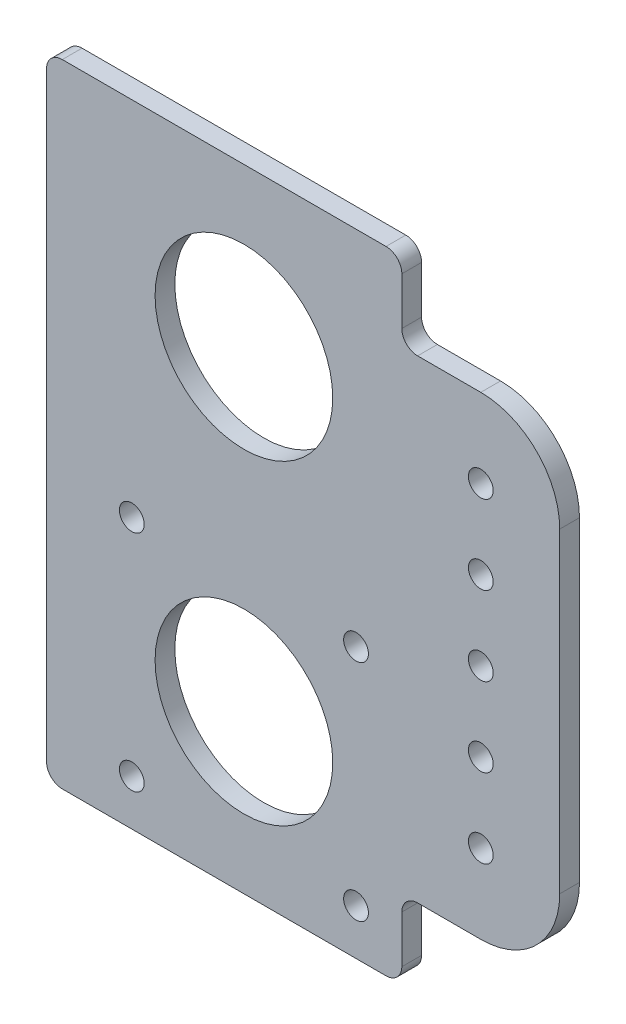
ISO-10303-21;
HEADER;
FILE_DESCRIPTION(('STEP AP214'),'2;1');
FILE_NAME('part.step','',(''),(''),'','','');
FILE_SCHEMA(('AUTOMOTIVE_DESIGN { 1 0 10303 214 1 1 1 1 }'));
ENDSEC;
DATA;
#1=APPLICATION_CONTEXT('core data for automotive mechanical design processes');
#2=APPLICATION_PROTOCOL_DEFINITION('international standard','automotive_design',2000,#1);
#3=PRODUCT_CONTEXT('',#1,'mechanical');
#4=PRODUCT('Part','Part','',(#3));
#5=PRODUCT_RELATED_PRODUCT_CATEGORY('part','',(#4));
#6=PRODUCT_DEFINITION_FORMATION('','',#4);
#7=PRODUCT_DEFINITION_CONTEXT('part definition',#1,'design');
#8=PRODUCT_DEFINITION('design','',#6,#7);
#9=PRODUCT_DEFINITION_SHAPE('','',#8);
#10=(LENGTH_UNIT() NAMED_UNIT(*) SI_UNIT(.MILLI.,.METRE.));
#11=(NAMED_UNIT(*) PLANE_ANGLE_UNIT() SI_UNIT($,.RADIAN.));
#12=(NAMED_UNIT(*) SI_UNIT($,.STERADIAN.) SOLID_ANGLE_UNIT());
#13=UNCERTAINTY_MEASURE_WITH_UNIT(LENGTH_MEASURE(1.E-05),#10,'distance_accuracy_value','');
#14=(GEOMETRIC_REPRESENTATION_CONTEXT(3) GLOBAL_UNCERTAINTY_ASSIGNED_CONTEXT((#13)) GLOBAL_UNIT_ASSIGNED_CONTEXT((#10,
#11,#12)) REPRESENTATION_CONTEXT('',''));
#15=CARTESIAN_POINT('',(0.,0.,0.));
#16=DIRECTION('',(0.,0.,1.));
#17=DIRECTION('',(1.,0.,0.));
#18=AXIS2_PLACEMENT_3D('',#15,#16,#17);
#19=CARTESIAN_POINT('',(38.1,0.,3.175));
#20=DIRECTION('',(0.,0.,-1.));
#21=DIRECTION('',(-1.,0.,0.));
#22=AXIS2_PLACEMENT_3D('',#19,#20,#21);
#23=CYLINDRICAL_SURFACE('',#22,12.7);
#24=CARTESIAN_POINT('',(38.1,0.,0.));
#25=DIRECTION('',(0.,0.,1.));
#26=DIRECTION('',(1.,0.,0.));
#27=AXIS2_PLACEMENT_3D('',#24,#25,#26);
#28=CIRCLE('',#27,12.7);
#29=CARTESIAN_POINT('',(50.8,0.,0.));
#30=VERTEX_POINT('',#29);
#31=CARTESIAN_POINT('',(38.1,-12.7,0.));
#32=VERTEX_POINT('',#31);
#33=EDGE_CURVE('E153',#30,#32,#28,.F.);
#34=ORIENTED_EDGE('',*,*,#33,.F.);
#35=DIRECTION('',(0.,0.,-1.));
#36=VECTOR('',#35,1.);
#37=CARTESIAN_POINT('',(50.8,0.,3.175));
#38=LINE('',#37,#36);
#39=CARTESIAN_POINT('',(50.8,0.,3.175));
#40=VERTEX_POINT('',#39);
#41=EDGE_CURVE('E148',#40,#30,#38,.T.);
#42=ORIENTED_EDGE('',*,*,#41,.F.);
#43=CARTESIAN_POINT('',(38.1,0.,3.175));
#44=DIRECTION('',(0.,0.,1.));
#45=DIRECTION('',(1.,0.,0.));
#46=AXIS2_PLACEMENT_3D('',#43,#44,#45);
#47=CIRCLE('',#46,12.7);
#48=CARTESIAN_POINT('',(38.1,-12.7,3.175));
#49=VERTEX_POINT('',#48);
#50=EDGE_CURVE('E150',#40,#49,#47,.F.);
#51=ORIENTED_EDGE('',*,*,#50,.T.);
#52=DIRECTION('',(0.,0.,-1.));
#53=VECTOR('',#52,1.);
#54=CARTESIAN_POINT('',(38.1,-12.7,3.175));
#55=LINE('',#54,#53);
#56=EDGE_CURVE('E225',#49,#32,#55,.T.);
#57=ORIENTED_EDGE('',*,*,#56,.T.);
#58=EDGE_LOOP('',(#34,#42,#51,#57));
#59=FACE_BOUND('',#58,.T.);
#60=ADVANCED_FACE('F34',(#59),#23,.T.);
#61=CARTESIAN_POINT('',(50.8,0.,3.175));
#62=DIRECTION('',(1.,0.,0.));
#63=DIRECTION('',(0.,1.,0.));
#64=AXIS2_PLACEMENT_3D('',#61,#62,#63);
#65=PLANE('',#64);
#66=DIRECTION('',(0.,-1.,0.));
#67=VECTOR('',#66,1.);
#68=CARTESIAN_POINT('',(50.8,0.,0.));
#69=LINE('',#68,#67);
#70=CARTESIAN_POINT('',(50.8,50.8,0.));
#71=VERTEX_POINT('',#70);
#72=EDGE_CURVE('E230',#71,#30,#69,.T.);
#73=ORIENTED_EDGE('',*,*,#72,.F.);
#74=DIRECTION('',(0.,0.,-1.));
#75=VECTOR('',#74,1.);
#76=CARTESIAN_POINT('',(50.8,50.8,3.175));
#77=LINE('',#76,#75);
#78=CARTESIAN_POINT('',(50.8,50.8,3.175));
#79=VERTEX_POINT('',#78);
#80=EDGE_CURVE('E159',#79,#71,#77,.T.);
#81=ORIENTED_EDGE('',*,*,#80,.F.);
#82=DIRECTION('',(0.,-1.,0.));
#83=VECTOR('',#82,1.);
#84=CARTESIAN_POINT('',(50.8,0.,3.175));
#85=LINE('',#84,#83);
#86=EDGE_CURVE('E166',#79,#40,#85,.T.);
#87=ORIENTED_EDGE('',*,*,#86,.T.);
#88=ORIENTED_EDGE('',*,*,#41,.T.);
#89=EDGE_LOOP('',(#73,#81,#87,#88));
#90=FACE_BOUND('',#89,.T.);
#91=ADVANCED_FACE('F171',(#90),#65,.T.);
#92=CARTESIAN_POINT('',(38.1,50.8,3.175));
#93=DIRECTION('',(0.,0.,-1.));
#94=DIRECTION('',(-1.,0.,0.));
#95=AXIS2_PLACEMENT_3D('',#92,#93,#94);
#96=CYLINDRICAL_SURFACE('',#95,12.7);
#97=CARTESIAN_POINT('',(38.1,50.8,0.));
#98=DIRECTION('',(0.,0.,1.));
#99=DIRECTION('',(1.,0.,0.));
#100=AXIS2_PLACEMENT_3D('',#97,#98,#99);
#101=CIRCLE('',#100,12.7);
#102=CARTESIAN_POINT('',(38.1,63.5,0.));
#103=VERTEX_POINT('',#102);
#104=EDGE_CURVE('E232',#71,#103,#101,.T.);
#105=ORIENTED_EDGE('',*,*,#104,.T.);
#106=DIRECTION('',(0.,0.,-1.));
#107=VECTOR('',#106,1.);
#108=CARTESIAN_POINT('',(38.1,63.5,3.175));
#109=LINE('',#108,#107);
#110=CARTESIAN_POINT('',(38.1,63.5,3.175));
#111=VERTEX_POINT('',#110);
#112=EDGE_CURVE('E286',#111,#103,#109,.T.);
#113=ORIENTED_EDGE('',*,*,#112,.F.);
#114=CARTESIAN_POINT('',(38.1,50.8,3.175));
#115=DIRECTION('',(0.,0.,1.));
#116=DIRECTION('',(1.,0.,0.));
#117=AXIS2_PLACEMENT_3D('',#114,#115,#116);
#118=CIRCLE('',#117,12.7);
#119=EDGE_CURVE('E173',#79,#111,#118,.T.);
#120=ORIENTED_EDGE('',*,*,#119,.F.);
#121=ORIENTED_EDGE('',*,*,#80,.T.);
#122=EDGE_LOOP('',(#105,#113,#120,#121));
#123=FACE_BOUND('',#122,.T.);
#124=ADVANCED_FACE('F391',(#123),#96,.T.);
#125=CARTESIAN_POINT('',(0.,63.5,3.175));
#126=DIRECTION('',(0.,-1.,0.));
#127=DIRECTION('',(0.,0.,-1.));
#128=AXIS2_PLACEMENT_3D('',#125,#126,#127);
#129=PLANE('',#128);
#130=DIRECTION('',(-1.,0.,0.));
#131=VECTOR('',#130,1.);
#132=CARTESIAN_POINT('',(0.,63.5,0.));
#133=LINE('',#132,#131);
#134=CARTESIAN_POINT('',(27.94,63.5,0.));
#135=VERTEX_POINT('',#134);
#136=EDGE_CURVE('E235',#103,#135,#133,.T.);
#137=ORIENTED_EDGE('',*,*,#136,.T.);
#138=DIRECTION('',(0.,0.,-1.));
#139=VECTOR('',#138,1.);
#140=CARTESIAN_POINT('',(27.94,63.5,3.175));
#141=LINE('',#140,#139);
#142=CARTESIAN_POINT('',(27.94,63.5,3.175));
#143=VERTEX_POINT('',#142);
#144=EDGE_CURVE('E331',#135,#143,#141,.F.);
#145=ORIENTED_EDGE('',*,*,#144,.T.);
#146=DIRECTION('',(-1.,0.,0.));
#147=VECTOR('',#146,1.);
#148=CARTESIAN_POINT('',(0.,63.5,3.175));
#149=LINE('',#148,#147);
#150=EDGE_CURVE('E175',#111,#143,#149,.T.);
#151=ORIENTED_EDGE('',*,*,#150,.F.);
#152=ORIENTED_EDGE('',*,*,#112,.T.);
#153=EDGE_LOOP('',(#137,#145,#151,#152));
#154=FACE_BOUND('',#153,.T.);
#155=ADVANCED_FACE('F345',(#154),#129,.F.);
#156=CARTESIAN_POINT('',(25.4,0.,3.175));
#157=DIRECTION('',(1.,0.,0.));
#158=DIRECTION('',(0.,1.,0.));
#159=AXIS2_PLACEMENT_3D('',#156,#157,#158);
#160=PLANE('',#159);
#161=DIRECTION('',(0.,-1.,0.));
#162=VECTOR('',#161,1.);
#163=CARTESIAN_POINT('',(25.4,0.,0.));
#164=LINE('',#163,#162);
#165=CARTESIAN_POINT('',(25.4,73.66,0.));
#166=VERTEX_POINT('',#165);
#167=CARTESIAN_POINT('',(25.4,66.04,0.));
#168=VERTEX_POINT('',#167);
#169=EDGE_CURVE('E238',#166,#168,#164,.T.);
#170=ORIENTED_EDGE('',*,*,#169,.F.);
#171=DIRECTION('',(0.,0.,-1.));
#172=VECTOR('',#171,1.);
#173=CARTESIAN_POINT('',(25.4,73.66,3.175));
#174=LINE('',#173,#172);
#175=CARTESIAN_POINT('',(25.4,73.66,3.175));
#176=VERTEX_POINT('',#175);
#177=EDGE_CURVE('E329',#166,#176,#174,.F.);
#178=ORIENTED_EDGE('',*,*,#177,.T.);
#179=DIRECTION('',(0.,-1.,0.));
#180=VECTOR('',#179,1.);
#181=CARTESIAN_POINT('',(25.4,0.,3.175));
#182=LINE('',#181,#180);
#183=CARTESIAN_POINT('',(25.4,66.04,3.175));
#184=VERTEX_POINT('',#183);
#185=EDGE_CURVE('E181',#176,#184,#182,.T.);
#186=ORIENTED_EDGE('',*,*,#185,.T.);
#187=DIRECTION('',(0.,0.,-1.));
#188=VECTOR('',#187,1.);
#189=CARTESIAN_POINT('',(25.4,66.04,3.175));
#190=LINE('',#189,#188);
#191=EDGE_CURVE('E326',#184,#168,#190,.T.);
#192=ORIENTED_EDGE('',*,*,#191,.T.);
#193=EDGE_LOOP('',(#170,#178,#186,#192));
#194=FACE_BOUND('',#193,.T.);
#195=ADVANCED_FACE('F351',(#194),#160,.T.);
#196=CARTESIAN_POINT('',(0.,76.2,3.175));
#197=DIRECTION('',(0.,1.,0.));
#198=DIRECTION('',(0.,0.,1.));
#199=AXIS2_PLACEMENT_3D('',#196,#197,#198);
#200=PLANE('',#199);
#201=DIRECTION('',(1.,0.,0.));
#202=VECTOR('',#201,1.);
#203=CARTESIAN_POINT('',(0.,76.2,0.));
#204=LINE('',#203,#202);
#205=CARTESIAN_POINT('',(-29.21,76.2,0.));
#206=VERTEX_POINT('',#205);
#207=CARTESIAN_POINT('',(22.86,76.2,0.));
#208=VERTEX_POINT('',#207);
#209=EDGE_CURVE('E241',#206,#208,#204,.T.);
#210=ORIENTED_EDGE('',*,*,#209,.F.);
#211=DIRECTION('',(0.,0.,-1.));
#212=VECTOR('',#211,1.);
#213=CARTESIAN_POINT('',(-29.21,76.2,3.175));
#214=LINE('',#213,#212);
#215=CARTESIAN_POINT('',(-29.21,76.2,3.175));
#216=VERTEX_POINT('',#215);
#217=EDGE_CURVE('E324',#206,#216,#214,.F.);
#218=ORIENTED_EDGE('',*,*,#217,.T.);
#219=DIRECTION('',(1.,0.,0.));
#220=VECTOR('',#219,1.);
#221=CARTESIAN_POINT('',(0.,76.2,3.175));
#222=LINE('',#221,#220);
#223=CARTESIAN_POINT('',(22.86,76.2,3.175));
#224=VERTEX_POINT('',#223);
#225=EDGE_CURVE('E184',#216,#224,#222,.T.);
#226=ORIENTED_EDGE('',*,*,#225,.T.);
#227=DIRECTION('',(0.,0.,-1.));
#228=VECTOR('',#227,1.);
#229=CARTESIAN_POINT('',(22.86,76.2,3.175));
#230=LINE('',#229,#228);
#231=EDGE_CURVE('E321',#224,#208,#230,.T.);
#232=ORIENTED_EDGE('',*,*,#231,.T.);
#233=EDGE_LOOP('',(#210,#218,#226,#232));
#234=FACE_BOUND('',#233,.T.);
#235=ADVANCED_FACE('F358',(#234),#200,.T.);
#236=CARTESIAN_POINT('',(-31.75,0.,3.175));
#237=DIRECTION('',(1.,0.,0.));
#238=DIRECTION('',(0.,1.,0.));
#239=AXIS2_PLACEMENT_3D('',#236,#237,#238);
#240=PLANE('',#239);
#241=DIRECTION('',(0.,-1.,0.));
#242=VECTOR('',#241,1.);
#243=CARTESIAN_POINT('',(-31.75,0.,0.));
#244=LINE('',#243,#242);
#245=CARTESIAN_POINT('',(-31.75,73.66,0.));
#246=VERTEX_POINT('',#245);
#247=CARTESIAN_POINT('',(-31.75,-22.86,0.));
#248=VERTEX_POINT('',#247);
#249=EDGE_CURVE('E244',#246,#248,#244,.T.);
#250=ORIENTED_EDGE('',*,*,#249,.T.);
#251=DIRECTION('',(0.,0.,-1.));
#252=VECTOR('',#251,1.);
#253=CARTESIAN_POINT('',(-31.75,-22.86,3.175));
#254=LINE('',#253,#252);
#255=CARTESIAN_POINT('',(-31.75,-22.86,3.175));
#256=VERTEX_POINT('',#255);
#257=EDGE_CURVE('E49',#248,#256,#254,.F.);
#258=ORIENTED_EDGE('',*,*,#257,.T.);
#259=DIRECTION('',(0.,-1.,0.));
#260=VECTOR('',#259,1.);
#261=CARTESIAN_POINT('',(-31.75,0.,3.175));
#262=LINE('',#261,#260);
#263=CARTESIAN_POINT('',(-31.75,73.66,3.175));
#264=VERTEX_POINT('',#263);
#265=EDGE_CURVE('E187',#264,#256,#262,.T.);
#266=ORIENTED_EDGE('',*,*,#265,.F.);
#267=DIRECTION('',(0.,0.,-1.));
#268=VECTOR('',#267,1.);
#269=CARTESIAN_POINT('',(-31.75,73.66,0.));
#270=LINE('',#269,#268);
#271=EDGE_CURVE('E317',#264,#246,#270,.T.);
#272=ORIENTED_EDGE('',*,*,#271,.T.);
#273=EDGE_LOOP('',(#250,#258,#266,#272));
#274=FACE_BOUND('',#273,.T.);
#275=ADVANCED_FACE('F364',(#274),#240,.F.);
#276=CARTESIAN_POINT('',(0.,-25.4,3.175));
#277=DIRECTION('',(0.,1.,0.));
#278=DIRECTION('',(0.,0.,1.));
#279=AXIS2_PLACEMENT_3D('',#276,#277,#278);
#280=PLANE('',#279);
#281=DIRECTION('',(1.,0.,0.));
#282=VECTOR('',#281,1.);
#283=CARTESIAN_POINT('',(0.,-25.4,0.));
#284=LINE('',#283,#282);
#285=CARTESIAN_POINT('',(-29.21,-25.4,0.));
#286=VERTEX_POINT('',#285);
#287=CARTESIAN_POINT('',(22.86,-25.4,0.));
#288=VERTEX_POINT('',#287);
#289=EDGE_CURVE('E246',#286,#288,#284,.T.);
#290=ORIENTED_EDGE('',*,*,#289,.T.);
#291=DIRECTION('',(0.,0.,-1.));
#292=VECTOR('',#291,1.);
#293=CARTESIAN_POINT('',(22.86,-25.4,3.175));
#294=LINE('',#293,#292);
#295=CARTESIAN_POINT('',(22.86,-25.4,3.175));
#296=VERTEX_POINT('',#295);
#297=EDGE_CURVE('E308',#288,#296,#294,.F.);
#298=ORIENTED_EDGE('',*,*,#297,.T.);
#299=DIRECTION('',(1.,0.,0.));
#300=VECTOR('',#299,1.);
#301=CARTESIAN_POINT('',(0.,-25.4,3.175));
#302=LINE('',#301,#300);
#303=CARTESIAN_POINT('',(-29.21,-25.4,3.175));
#304=VERTEX_POINT('',#303);
#305=EDGE_CURVE('E189',#304,#296,#302,.T.);
#306=ORIENTED_EDGE('',*,*,#305,.F.);
#307=DIRECTION('',(0.,0.,-1.));
#308=VECTOR('',#307,1.);
#309=CARTESIAN_POINT('',(-29.21,-25.4,3.175));
#310=LINE('',#309,#308);
#311=EDGE_CURVE('E305',#304,#286,#310,.T.);
#312=ORIENTED_EDGE('',*,*,#311,.T.);
#313=EDGE_LOOP('',(#290,#298,#306,#312));
#314=FACE_BOUND('',#313,.T.);
#315=ADVANCED_FACE('F372',(#314),#280,.F.);
#316=CARTESIAN_POINT('',(25.4,0.,3.175));
#317=DIRECTION('',(1.,0.,0.));
#318=DIRECTION('',(0.,1.,0.));
#319=AXIS2_PLACEMENT_3D('',#316,#317,#318);
#320=PLANE('',#319);
#321=DIRECTION('',(0.,-1.,0.));
#322=VECTOR('',#321,1.);
#323=CARTESIAN_POINT('',(25.4,0.,0.));
#324=LINE('',#323,#322);
#325=CARTESIAN_POINT('',(25.4,-15.24,0.));
#326=VERTEX_POINT('',#325);
#327=CARTESIAN_POINT('',(25.4,-22.86,0.));
#328=VERTEX_POINT('',#327);
#329=EDGE_CURVE('E249',#326,#328,#324,.T.);
#330=ORIENTED_EDGE('',*,*,#329,.F.);
#331=DIRECTION('',(0.,0.,-1.));
#332=VECTOR('',#331,1.);
#333=CARTESIAN_POINT('',(25.4,-15.24,3.175));
#334=LINE('',#333,#332);
#335=CARTESIAN_POINT('',(25.4,-15.24,3.175));
#336=VERTEX_POINT('',#335);
#337=EDGE_CURVE('E295',#326,#336,#334,.F.);
#338=ORIENTED_EDGE('',*,*,#337,.T.);
#339=DIRECTION('',(0.,-1.,0.));
#340=VECTOR('',#339,1.);
#341=CARTESIAN_POINT('',(25.4,0.,3.175));
#342=LINE('',#341,#340);
#343=CARTESIAN_POINT('',(25.4,-22.86,3.175));
#344=VERTEX_POINT('',#343);
#345=EDGE_CURVE('E191',#336,#344,#342,.T.);
#346=ORIENTED_EDGE('',*,*,#345,.T.);
#347=DIRECTION('',(0.,0.,-1.));
#348=VECTOR('',#347,1.);
#349=CARTESIAN_POINT('',(25.4,-22.86,0.));
#350=LINE('',#349,#348);
#351=EDGE_CURVE('E292',#344,#328,#350,.T.);
#352=ORIENTED_EDGE('',*,*,#351,.T.);
#353=EDGE_LOOP('',(#330,#338,#346,#352));
#354=FACE_BOUND('',#353,.T.);
#355=ADVANCED_FACE('F381',(#354),#320,.T.);
#356=CARTESIAN_POINT('',(18.0340000000001,18.0339999999999,3.175));
#357=DIRECTION('',(0.,0.,-1.));
#358=DIRECTION('',(-1.,0.,0.));
#359=AXIS2_PLACEMENT_3D('',#356,#357,#358);
#360=CYLINDRICAL_SURFACE('',#359,1.9939);
#361=CARTESIAN_POINT('',(18.0340000000001,18.0339999999999,3.175));
#362=DIRECTION('',(0.,0.,1.));
#363=DIRECTION('',(1.,0.,0.));
#364=AXIS2_PLACEMENT_3D('',#361,#362,#363);
#365=CIRCLE('',#364,1.9939);
#366=CARTESIAN_POINT('',(20.0279000000001,18.0339999999999,3.175));
#367=VERTEX_POINT('',#366);
#368=EDGE_CURVE('E219',#367,#367,#365,.T.);
#369=ORIENTED_EDGE('',*,*,#368,.T.);
#370=EDGE_LOOP('',(#369));
#371=FACE_BOUND('',#370,.T.);
#372=CARTESIAN_POINT('',(18.0340000000001,18.0339999999999,0.));
#373=DIRECTION('',(0.,0.,1.));
#374=DIRECTION('',(1.,0.,0.));
#375=AXIS2_PLACEMENT_3D('',#372,#373,#374);
#376=CIRCLE('',#375,1.9939);
#377=CARTESIAN_POINT('',(20.0279000000001,18.0339999999999,0.));
#378=VERTEX_POINT('',#377);
#379=EDGE_CURVE('E279',#378,#378,#376,.T.);
#380=ORIENTED_EDGE('',*,*,#379,.F.);
#381=EDGE_LOOP('',(#380));
#382=FACE_BOUND('',#381,.T.);
#383=ADVANCED_FACE('F492',(#371,#382),#360,.F.);
#384=CARTESIAN_POINT('',(18.0339999999999,-18.0340000000001,3.175));
#385=DIRECTION('',(0.,0.,-1.));
#386=DIRECTION('',(-1.,0.,0.));
#387=AXIS2_PLACEMENT_3D('',#384,#385,#386);
#388=CYLINDRICAL_SURFACE('',#387,1.9939);
#389=CARTESIAN_POINT('',(18.0339999999999,-18.0340000000001,3.175));
#390=DIRECTION('',(0.,0.,1.));
#391=DIRECTION('',(1.,0.,0.));
#392=AXIS2_PLACEMENT_3D('',#389,#390,#391);
#393=CIRCLE('',#392,1.9939);
#394=CARTESIAN_POINT('',(20.0278999999999,-18.0340000000001,3.175));
#395=VERTEX_POINT('',#394);
#396=EDGE_CURVE('E216',#395,#395,#393,.T.);
#397=ORIENTED_EDGE('',*,*,#396,.T.);
#398=EDGE_LOOP('',(#397));
#399=FACE_BOUND('',#398,.T.);
#400=CARTESIAN_POINT('',(18.0339999999999,-18.0340000000001,0.));
#401=DIRECTION('',(0.,0.,1.));
#402=DIRECTION('',(1.,0.,0.));
#403=AXIS2_PLACEMENT_3D('',#400,#401,#402);
#404=CIRCLE('',#403,1.9939);
#405=CARTESIAN_POINT('',(20.0278999999999,-18.0340000000001,0.));
#406=VERTEX_POINT('',#405);
#407=EDGE_CURVE('E276',#406,#406,#404,.T.);
#408=ORIENTED_EDGE('',*,*,#407,.F.);
#409=EDGE_LOOP('',(#408));
#410=FACE_BOUND('',#409,.T.);
#411=ADVANCED_FACE('F614',(#399,#410),#388,.F.);
#412=CARTESIAN_POINT('',(-18.0340000000002,-18.0339999999998,3.175));
#413=DIRECTION('',(0.,0.,-1.));
#414=DIRECTION('',(-1.,0.,0.));
#415=AXIS2_PLACEMENT_3D('',#412,#413,#414);
#416=CYLINDRICAL_SURFACE('',#415,1.9939);
#417=CARTESIAN_POINT('',(-18.0340000000002,-18.0339999999998,3.175));
#418=DIRECTION('',(0.,0.,1.));
#419=DIRECTION('',(1.,0.,0.));
#420=AXIS2_PLACEMENT_3D('',#417,#418,#419);
#421=CIRCLE('',#420,1.9939);
#422=CARTESIAN_POINT('',(-16.0401000000002,-18.0339999999998,3.175));
#423=VERTEX_POINT('',#422);
#424=EDGE_CURVE('E213',#423,#423,#421,.T.);
#425=ORIENTED_EDGE('',*,*,#424,.T.);
#426=EDGE_LOOP('',(#425));
#427=FACE_BOUND('',#426,.T.);
#428=CARTESIAN_POINT('',(-18.0340000000002,-18.0339999999998,0.));
#429=DIRECTION('',(0.,0.,1.));
#430=DIRECTION('',(1.,0.,0.));
#431=AXIS2_PLACEMENT_3D('',#428,#429,#430);
#432=CIRCLE('',#431,1.9939);
#433=CARTESIAN_POINT('',(-16.0401000000002,-18.0339999999998,0.));
#434=VERTEX_POINT('',#433);
#435=EDGE_CURVE('E273',#434,#434,#432,.T.);
#436=ORIENTED_EDGE('',*,*,#435,.F.);
#437=EDGE_LOOP('',(#436));
#438=FACE_BOUND('',#437,.T.);
#439=ADVANCED_FACE('F604',(#427,#438),#416,.F.);
#440=CARTESIAN_POINT('',(0.,50.8,3.175));
#441=DIRECTION('',(0.,0.,-1.));
#442=DIRECTION('',(-1.,0.,0.));
#443=AXIS2_PLACEMENT_3D('',#440,#441,#442);
#444=CYLINDRICAL_SURFACE('',#443,14.2875);
#445=CARTESIAN_POINT('',(0.,50.8,3.175));
#446=DIRECTION('',(0.,0.,1.));
#447=DIRECTION('',(1.,0.,0.));
#448=AXIS2_PLACEMENT_3D('',#445,#446,#447);
#449=CIRCLE('',#448,14.2875);
#450=CARTESIAN_POINT('',(14.2875,50.8,3.175));
#451=VERTEX_POINT('',#450);
#452=EDGE_CURVE('E210',#451,#451,#449,.T.);
#453=ORIENTED_EDGE('',*,*,#452,.T.);
#454=EDGE_LOOP('',(#453));
#455=FACE_BOUND('',#454,.T.);
#456=CARTESIAN_POINT('',(0.,50.8,0.));
#457=DIRECTION('',(0.,0.,1.));
#458=DIRECTION('',(1.,0.,0.));
#459=AXIS2_PLACEMENT_3D('',#456,#457,#458);
#460=CIRCLE('',#459,14.2875);
#461=CARTESIAN_POINT('',(14.2875,50.8,0.));
#462=VERTEX_POINT('',#461);
#463=EDGE_CURVE('E270',#462,#462,#460,.T.);
#464=ORIENTED_EDGE('',*,*,#463,.F.);
#465=EDGE_LOOP('',(#464));
#466=FACE_BOUND('',#465,.T.);
#467=ADVANCED_FACE('F594',(#455,#466),#444,.F.);
#468=CARTESIAN_POINT('',(38.1,50.8,3.175));
#469=DIRECTION('',(0.,0.,-1.));
#470=DIRECTION('',(-1.,0.,0.));
#471=AXIS2_PLACEMENT_3D('',#468,#469,#470);
#472=CYLINDRICAL_SURFACE('',#471,1.9939);
#473=CARTESIAN_POINT('',(38.1,50.8,3.175));
#474=DIRECTION('',(0.,0.,1.));
#475=DIRECTION('',(1.,0.,0.));
#476=AXIS2_PLACEMENT_3D('',#473,#474,#475);
#477=CIRCLE('',#476,1.9939);
#478=CARTESIAN_POINT('',(40.0939,50.8,3.175));
#479=VERTEX_POINT('',#478);
#480=EDGE_CURVE('E207',#479,#479,#477,.T.);
#481=ORIENTED_EDGE('',*,*,#480,.T.);
#482=EDGE_LOOP('',(#481));
#483=FACE_BOUND('',#482,.T.);
#484=CARTESIAN_POINT('',(38.1,50.8,0.));
#485=DIRECTION('',(0.,0.,1.));
#486=DIRECTION('',(1.,0.,0.));
#487=AXIS2_PLACEMENT_3D('',#484,#485,#486);
#488=CIRCLE('',#487,1.9939);
#489=CARTESIAN_POINT('',(40.0939,50.8,0.));
#490=VERTEX_POINT('',#489);
#491=EDGE_CURVE('E267',#490,#490,#488,.T.);
#492=ORIENTED_EDGE('',*,*,#491,.F.);
#493=EDGE_LOOP('',(#492));
#494=FACE_BOUND('',#493,.T.);
#495=ADVANCED_FACE('F584',(#483,#494),#472,.F.);
#496=CARTESIAN_POINT('',(38.1,38.1,3.175));
#497=DIRECTION('',(0.,0.,-1.));
#498=DIRECTION('',(-1.,0.,0.));
#499=AXIS2_PLACEMENT_3D('',#496,#497,#498);
#500=CYLINDRICAL_SURFACE('',#499,1.9939);
#501=CARTESIAN_POINT('',(38.1,38.1,3.175));
#502=DIRECTION('',(0.,0.,1.));
#503=DIRECTION('',(1.,0.,0.));
#504=AXIS2_PLACEMENT_3D('',#501,#502,#503);
#505=CIRCLE('',#504,1.9939);
#506=CARTESIAN_POINT('',(40.0939,38.1,3.175));
#507=VERTEX_POINT('',#506);
#508=EDGE_CURVE('E204',#507,#507,#505,.T.);
#509=ORIENTED_EDGE('',*,*,#508,.T.);
#510=EDGE_LOOP('',(#509));
#511=FACE_BOUND('',#510,.T.);
#512=CARTESIAN_POINT('',(38.1,38.1,0.));
#513=DIRECTION('',(0.,0.,1.));
#514=DIRECTION('',(1.,0.,0.));
#515=AXIS2_PLACEMENT_3D('',#512,#513,#514);
#516=CIRCLE('',#515,1.9939);
#517=CARTESIAN_POINT('',(40.0939,38.1,0.));
#518=VERTEX_POINT('',#517);
#519=EDGE_CURVE('E264',#518,#518,#516,.T.);
#520=ORIENTED_EDGE('',*,*,#519,.F.);
#521=EDGE_LOOP('',(#520));
#522=FACE_BOUND('',#521,.T.);
#523=ADVANCED_FACE('F574',(#511,#522),#500,.F.);
#524=CARTESIAN_POINT('',(38.1,25.4,3.175));
#525=DIRECTION('',(0.,0.,-1.));
#526=DIRECTION('',(-1.,0.,0.));
#527=AXIS2_PLACEMENT_3D('',#524,#525,#526);
#528=CYLINDRICAL_SURFACE('',#527,1.9939);
#529=CARTESIAN_POINT('',(38.1,25.4,3.175));
#530=DIRECTION('',(0.,0.,1.));
#531=DIRECTION('',(1.,0.,0.));
#532=AXIS2_PLACEMENT_3D('',#529,#530,#531);
#533=CIRCLE('',#532,1.9939);
#534=CARTESIAN_POINT('',(40.0939,25.4,3.175));
#535=VERTEX_POINT('',#534);
#536=EDGE_CURVE('E201',#535,#535,#533,.T.);
#537=ORIENTED_EDGE('',*,*,#536,.T.);
#538=EDGE_LOOP('',(#537));
#539=FACE_BOUND('',#538,.T.);
#540=CARTESIAN_POINT('',(38.1,25.4,0.));
#541=DIRECTION('',(0.,0.,1.));
#542=DIRECTION('',(1.,0.,0.));
#543=AXIS2_PLACEMENT_3D('',#540,#541,#542);
#544=CIRCLE('',#543,1.9939);
#545=CARTESIAN_POINT('',(40.0939,25.4,0.));
#546=VERTEX_POINT('',#545);
#547=EDGE_CURVE('E261',#546,#546,#544,.T.);
#548=ORIENTED_EDGE('',*,*,#547,.F.);
#549=EDGE_LOOP('',(#548));
#550=FACE_BOUND('',#549,.T.);
#551=ADVANCED_FACE('F564',(#539,#550),#528,.F.);
#552=CARTESIAN_POINT('',(38.1,12.7,3.175));
#553=DIRECTION('',(0.,0.,-1.));
#554=DIRECTION('',(-1.,0.,0.));
#555=AXIS2_PLACEMENT_3D('',#552,#553,#554);
#556=CYLINDRICAL_SURFACE('',#555,1.9939);
#557=CARTESIAN_POINT('',(38.1,12.7,3.175));
#558=DIRECTION('',(0.,0.,1.));
#559=DIRECTION('',(1.,0.,0.));
#560=AXIS2_PLACEMENT_3D('',#557,#558,#559);
#561=CIRCLE('',#560,1.9939);
#562=CARTESIAN_POINT('',(40.0939,12.7,3.175));
#563=VERTEX_POINT('',#562);
#564=EDGE_CURVE('E198',#563,#563,#561,.T.);
#565=ORIENTED_EDGE('',*,*,#564,.T.);
#566=EDGE_LOOP('',(#565));
#567=FACE_BOUND('',#566,.T.);
#568=CARTESIAN_POINT('',(38.1,12.7,0.));
#569=DIRECTION('',(0.,0.,1.));
#570=DIRECTION('',(1.,0.,0.));
#571=AXIS2_PLACEMENT_3D('',#568,#569,#570);
#572=CIRCLE('',#571,1.9939);
#573=CARTESIAN_POINT('',(40.0939,12.7,0.));
#574=VERTEX_POINT('',#573);
#575=EDGE_CURVE('E258',#574,#574,#572,.T.);
#576=ORIENTED_EDGE('',*,*,#575,.F.);
#577=EDGE_LOOP('',(#576));
#578=FACE_BOUND('',#577,.T.);
#579=ADVANCED_FACE('F554',(#567,#578),#556,.F.);
#580=CARTESIAN_POINT('',(38.1,0.,3.175));
#581=DIRECTION('',(0.,0.,-1.));
#582=DIRECTION('',(-1.,0.,0.));
#583=AXIS2_PLACEMENT_3D('',#580,#581,#582);
#584=CYLINDRICAL_SURFACE('',#583,1.9939);
#585=CARTESIAN_POINT('',(38.1,0.,3.175));
#586=DIRECTION('',(0.,0.,1.));
#587=DIRECTION('',(1.,0.,0.));
#588=AXIS2_PLACEMENT_3D('',#585,#586,#587);
#589=CIRCLE('',#588,1.9939);
#590=CARTESIAN_POINT('',(40.0939,0.,3.175));
#591=VERTEX_POINT('',#590);
#592=EDGE_CURVE('E195',#591,#591,#589,.T.);
#593=ORIENTED_EDGE('',*,*,#592,.T.);
#594=EDGE_LOOP('',(#593));
#595=FACE_BOUND('',#594,.T.);
#596=CARTESIAN_POINT('',(38.1,0.,0.));
#597=DIRECTION('',(0.,0.,1.));
#598=DIRECTION('',(1.,0.,0.));
#599=AXIS2_PLACEMENT_3D('',#596,#597,#598);
#600=CIRCLE('',#599,1.9939);
#601=CARTESIAN_POINT('',(40.0939,0.,0.));
#602=VERTEX_POINT('',#601);
#603=EDGE_CURVE('E255',#602,#602,#600,.T.);
#604=ORIENTED_EDGE('',*,*,#603,.F.);
#605=EDGE_LOOP('',(#604));
#606=FACE_BOUND('',#605,.T.);
#607=ADVANCED_FACE('F480',(#595,#606),#584,.F.);
#608=CARTESIAN_POINT('',(0.,-12.7,3.175));
#609=DIRECTION('',(0.,-1.,0.));
#610=DIRECTION('',(0.,0.,-1.));
#611=AXIS2_PLACEMENT_3D('',#608,#609,#610);
#612=PLANE('',#611);
#613=DIRECTION('',(-1.,0.,0.));
#614=VECTOR('',#613,1.);
#615=CARTESIAN_POINT('',(0.,-12.7,3.175));
#616=LINE('',#615,#614);
#617=CARTESIAN_POINT('',(27.94,-12.7,3.175));
#618=VERTEX_POINT('',#617);
#619=EDGE_CURVE('E168',#49,#618,#616,.T.);
#620=ORIENTED_EDGE('',*,*,#619,.T.);
#621=DIRECTION('',(0.,0.,-1.));
#622=VECTOR('',#621,1.);
#623=CARTESIAN_POINT('',(27.94,-12.7,0.));
#624=LINE('',#623,#622);
#625=CARTESIAN_POINT('',(27.94,-12.7,0.));
#626=VERTEX_POINT('',#625);
#627=EDGE_CURVE('E158',#618,#626,#624,.T.);
#628=ORIENTED_EDGE('',*,*,#627,.T.);
#629=DIRECTION('',(-1.,0.,0.));
#630=VECTOR('',#629,1.);
#631=CARTESIAN_POINT('',(0.,-12.7,0.));
#632=LINE('',#631,#630);
#633=EDGE_CURVE('E252',#32,#626,#632,.T.);
#634=ORIENTED_EDGE('',*,*,#633,.F.);
#635=ORIENTED_EDGE('',*,*,#56,.F.);
#636=EDGE_LOOP('',(#620,#628,#634,#635));
#637=FACE_BOUND('',#636,.T.);
#638=ADVANCED_FACE('F389',(#637),#612,.T.);
#639=CARTESIAN_POINT('',(0.,0.,3.175));
#640=DIRECTION('',(0.,0.,-1.));
#641=DIRECTION('',(-1.,0.,0.));
#642=AXIS2_PLACEMENT_3D('',#639,#640,#641);
#643=CYLINDRICAL_SURFACE('',#642,14.2875);
#644=CARTESIAN_POINT('',(0.,0.,3.175));
#645=DIRECTION('',(0.,0.,1.));
#646=DIRECTION('',(1.,0.,0.));
#647=AXIS2_PLACEMENT_3D('',#644,#645,#646);
#648=CIRCLE('',#647,14.2875);
#649=CARTESIAN_POINT('',(14.2875,0.,3.175));
#650=VERTEX_POINT('',#649);
#651=EDGE_CURVE('E169',#650,#650,#648,.T.);
#652=ORIENTED_EDGE('',*,*,#651,.T.);
#653=EDGE_LOOP('',(#652));
#654=FACE_BOUND('',#653,.T.);
#655=CARTESIAN_POINT('',(0.,0.,0.));
#656=DIRECTION('',(0.,0.,1.));
#657=DIRECTION('',(1.,0.,0.));
#658=AXIS2_PLACEMENT_3D('',#655,#656,#657);
#659=CIRCLE('',#658,14.2875);
#660=CARTESIAN_POINT('',(14.2875,0.,0.));
#661=VERTEX_POINT('',#660);
#662=EDGE_CURVE('E226',#661,#661,#659,.T.);
#663=ORIENTED_EDGE('',*,*,#662,.F.);
#664=EDGE_LOOP('',(#663));
#665=FACE_BOUND('',#664,.T.);
#666=ADVANCED_FACE('F405',(#654,#665),#643,.F.);
#667=CARTESIAN_POINT('',(-18.034,18.034,3.175));
#668=DIRECTION('',(0.,0.,-1.));
#669=DIRECTION('',(-1.,0.,0.));
#670=AXIS2_PLACEMENT_3D('',#667,#668,#669);
#671=CYLINDRICAL_SURFACE('',#670,1.9939);
#672=CARTESIAN_POINT('',(-18.034,18.034,3.175));
#673=DIRECTION('',(0.,0.,1.));
#674=DIRECTION('',(1.,0.,0.));
#675=AXIS2_PLACEMENT_3D('',#672,#673,#674);
#676=CIRCLE('',#675,1.9939);
#677=CARTESIAN_POINT('',(-16.0401,18.034,3.175));
#678=VERTEX_POINT('',#677);
#679=EDGE_CURVE('E222',#678,#678,#676,.T.);
#680=ORIENTED_EDGE('',*,*,#679,.T.);
#681=EDGE_LOOP('',(#680));
#682=FACE_BOUND('',#681,.T.);
#683=CARTESIAN_POINT('',(-18.034,18.034,0.));
#684=DIRECTION('',(0.,0.,1.));
#685=DIRECTION('',(1.,0.,0.));
#686=AXIS2_PLACEMENT_3D('',#683,#684,#685);
#687=CIRCLE('',#686,1.9939);
#688=CARTESIAN_POINT('',(-16.0401,18.034,0.));
#689=VERTEX_POINT('',#688);
#690=EDGE_CURVE('E282',#689,#689,#687,.T.);
#691=ORIENTED_EDGE('',*,*,#690,.F.);
#692=EDGE_LOOP('',(#691));
#693=FACE_BOUND('',#692,.T.);
#694=ADVANCED_FACE('F408',(#682,#693),#671,.F.);
#695=CARTESIAN_POINT('',(0.,0.,3.175));
#696=DIRECTION('',(0.,0.,1.));
#697=DIRECTION('',(1.,0.,0.));
#698=AXIS2_PLACEMENT_3D('',#695,#696,#697);
#699=PLANE('',#698);
#700=ORIENTED_EDGE('',*,*,#651,.F.);
#701=EDGE_LOOP('',(#700));
#702=FACE_BOUND('',#701,.T.);
#703=ORIENTED_EDGE('',*,*,#305,.T.);
#704=CARTESIAN_POINT('',(22.86,-22.86,3.175));
#705=DIRECTION('',(0.,0.,1.));
#706=DIRECTION('',(1.,0.,0.));
#707=AXIS2_PLACEMENT_3D('',#704,#705,#706);
#708=CIRCLE('',#707,2.54);
#709=EDGE_CURVE('E315',#296,#344,#708,.T.);
#710=ORIENTED_EDGE('',*,*,#709,.T.);
#711=ORIENTED_EDGE('',*,*,#345,.F.);
#712=CARTESIAN_POINT('',(27.94,-15.24,3.175));
#713=DIRECTION('',(0.,0.,1.));
#714=DIRECTION('',(1.,0.,0.));
#715=AXIS2_PLACEMENT_3D('',#712,#713,#714);
#716=CIRCLE('',#715,2.54);
#717=EDGE_CURVE('E335',#336,#618,#716,.F.);
#718=ORIENTED_EDGE('',*,*,#717,.T.);
#719=ORIENTED_EDGE('',*,*,#619,.F.);
#720=ORIENTED_EDGE('',*,*,#50,.F.);
#721=ORIENTED_EDGE('',*,*,#86,.F.);
#722=ORIENTED_EDGE('',*,*,#119,.T.);
#723=ORIENTED_EDGE('',*,*,#150,.T.);
#724=CARTESIAN_POINT('',(27.94,66.04,3.175));
#725=DIRECTION('',(0.,0.,1.));
#726=DIRECTION('',(1.,0.,0.));
#727=AXIS2_PLACEMENT_3D('',#724,#725,#726);
#728=CIRCLE('',#727,2.54);
#729=EDGE_CURVE('E11',#143,#184,#728,.F.);
#730=ORIENTED_EDGE('',*,*,#729,.T.);
#731=ORIENTED_EDGE('',*,*,#185,.F.);
#732=CARTESIAN_POINT('',(22.86,73.66,3.175));
#733=DIRECTION('',(0.,0.,1.));
#734=DIRECTION('',(1.,0.,0.));
#735=AXIS2_PLACEMENT_3D('',#732,#733,#734);
#736=CIRCLE('',#735,2.54);
#737=EDGE_CURVE('E310',#176,#224,#736,.T.);
#738=ORIENTED_EDGE('',*,*,#737,.T.);
#739=ORIENTED_EDGE('',*,*,#225,.F.);
#740=CARTESIAN_POINT('',(-29.21,73.66,3.175));
#741=DIRECTION('',(0.,0.,1.));
#742=DIRECTION('',(1.,0.,0.));
#743=AXIS2_PLACEMENT_3D('',#740,#741,#742);
#744=CIRCLE('',#743,2.54);
#745=EDGE_CURVE('E56',#216,#264,#744,.T.);
#746=ORIENTED_EDGE('',*,*,#745,.T.);
#747=ORIENTED_EDGE('',*,*,#265,.T.);
#748=CARTESIAN_POINT('',(-29.21,-22.86,3.175));
#749=DIRECTION('',(0.,0.,1.));
#750=DIRECTION('',(1.,0.,0.));
#751=AXIS2_PLACEMENT_3D('',#748,#749,#750);
#752=CIRCLE('',#751,2.54);
#753=EDGE_CURVE('E313',#256,#304,#752,.T.);
#754=ORIENTED_EDGE('',*,*,#753,.T.);
#755=EDGE_LOOP('',(#703,#710,#711,#718,#719,#720,#721,#722,#723,#730,#731,#738,#739,#746,#747,#754));
#756=FACE_BOUND('',#755,.T.);
#757=ORIENTED_EDGE('',*,*,#592,.F.);
#758=EDGE_LOOP('',(#757));
#759=FACE_BOUND('',#758,.T.);
#760=ORIENTED_EDGE('',*,*,#564,.F.);
#761=EDGE_LOOP('',(#760));
#762=FACE_BOUND('',#761,.T.);
#763=ORIENTED_EDGE('',*,*,#536,.F.);
#764=EDGE_LOOP('',(#763));
#765=FACE_BOUND('',#764,.T.);
#766=ORIENTED_EDGE('',*,*,#508,.F.);
#767=EDGE_LOOP('',(#766));
#768=FACE_BOUND('',#767,.T.);
#769=ORIENTED_EDGE('',*,*,#480,.F.);
#770=EDGE_LOOP('',(#769));
#771=FACE_BOUND('',#770,.T.);
#772=ORIENTED_EDGE('',*,*,#452,.F.);
#773=EDGE_LOOP('',(#772));
#774=FACE_BOUND('',#773,.T.);
#775=ORIENTED_EDGE('',*,*,#424,.F.);
#776=EDGE_LOOP('',(#775));
#777=FACE_BOUND('',#776,.T.);
#778=ORIENTED_EDGE('',*,*,#396,.F.);
#779=EDGE_LOOP('',(#778));
#780=FACE_BOUND('',#779,.T.);
#781=ORIENTED_EDGE('',*,*,#368,.F.);
#782=EDGE_LOOP('',(#781));
#783=FACE_BOUND('',#782,.T.);
#784=ORIENTED_EDGE('',*,*,#679,.F.);
#785=EDGE_LOOP('',(#784));
#786=FACE_BOUND('',#785,.T.);
#787=ADVANCED_FACE('F163',(#702,#756,#759,#762,#765,#768,#771,#774,#777,#780,#783,#786),#699,.T.);
#788=CARTESIAN_POINT('',(0.,0.,0.));
#789=DIRECTION('',(0.,0.,1.));
#790=DIRECTION('',(1.,0.,0.));
#791=AXIS2_PLACEMENT_3D('',#788,#789,#790);
#792=PLANE('',#791);
#793=ORIENTED_EDGE('',*,*,#662,.T.);
#794=EDGE_LOOP('',(#793));
#795=FACE_BOUND('',#794,.T.);
#796=ORIENTED_EDGE('',*,*,#329,.T.);
#797=CARTESIAN_POINT('',(22.86,-22.86,0.));
#798=DIRECTION('',(0.,0.,1.));
#799=DIRECTION('',(1.,0.,0.));
#800=AXIS2_PLACEMENT_3D('',#797,#798,#799);
#801=CIRCLE('',#800,2.54);
#802=EDGE_CURVE('E303',#328,#288,#801,.F.);
#803=ORIENTED_EDGE('',*,*,#802,.T.);
#804=ORIENTED_EDGE('',*,*,#289,.F.);
#805=CARTESIAN_POINT('',(-29.21,-22.86,0.));
#806=DIRECTION('',(0.,0.,1.));
#807=DIRECTION('',(1.,0.,0.));
#808=AXIS2_PLACEMENT_3D('',#805,#806,#807);
#809=CIRCLE('',#808,2.54);
#810=EDGE_CURVE('E301',#286,#248,#809,.F.);
#811=ORIENTED_EDGE('',*,*,#810,.T.);
#812=ORIENTED_EDGE('',*,*,#249,.F.);
#813=CARTESIAN_POINT('',(-29.21,73.66,0.));
#814=DIRECTION('',(0.,0.,1.));
#815=DIRECTION('',(1.,0.,0.));
#816=AXIS2_PLACEMENT_3D('',#813,#814,#815);
#817=CIRCLE('',#816,2.54);
#818=EDGE_CURVE('E299',#246,#206,#817,.F.);
#819=ORIENTED_EDGE('',*,*,#818,.T.);
#820=ORIENTED_EDGE('',*,*,#209,.T.);
#821=CARTESIAN_POINT('',(22.86,73.66,0.));
#822=DIRECTION('',(0.,0.,1.));
#823=DIRECTION('',(1.,0.,0.));
#824=AXIS2_PLACEMENT_3D('',#821,#822,#823);
#825=CIRCLE('',#824,2.54);
#826=EDGE_CURVE('E297',#208,#166,#825,.F.);
#827=ORIENTED_EDGE('',*,*,#826,.T.);
#828=ORIENTED_EDGE('',*,*,#169,.T.);
#829=CARTESIAN_POINT('',(27.94,66.04,0.));
#830=DIRECTION('',(0.,0.,1.));
#831=DIRECTION('',(1.,0.,0.));
#832=AXIS2_PLACEMENT_3D('',#829,#830,#831);
#833=CIRCLE('',#832,2.54);
#834=EDGE_CURVE('E42',#168,#135,#833,.T.);
#835=ORIENTED_EDGE('',*,*,#834,.T.);
#836=ORIENTED_EDGE('',*,*,#136,.F.);
#837=ORIENTED_EDGE('',*,*,#104,.F.);
#838=ORIENTED_EDGE('',*,*,#72,.T.);
#839=ORIENTED_EDGE('',*,*,#33,.T.);
#840=ORIENTED_EDGE('',*,*,#633,.T.);
#841=CARTESIAN_POINT('',(27.94,-15.24,0.));
#842=DIRECTION('',(0.,0.,1.));
#843=DIRECTION('',(1.,0.,0.));
#844=AXIS2_PLACEMENT_3D('',#841,#842,#843);
#845=CIRCLE('',#844,2.54);
#846=EDGE_CURVE('E333',#626,#326,#845,.T.);
#847=ORIENTED_EDGE('',*,*,#846,.T.);
#848=EDGE_LOOP('',(#796,#803,#804,#811,#812,#819,#820,#827,#828,#835,#836,#837,#838,#839,#840,#847));
#849=FACE_BOUND('',#848,.T.);
#850=ORIENTED_EDGE('',*,*,#603,.T.);
#851=EDGE_LOOP('',(#850));
#852=FACE_BOUND('',#851,.T.);
#853=ORIENTED_EDGE('',*,*,#575,.T.);
#854=EDGE_LOOP('',(#853));
#855=FACE_BOUND('',#854,.T.);
#856=ORIENTED_EDGE('',*,*,#547,.T.);
#857=EDGE_LOOP('',(#856));
#858=FACE_BOUND('',#857,.T.);
#859=ORIENTED_EDGE('',*,*,#519,.T.);
#860=EDGE_LOOP('',(#859));
#861=FACE_BOUND('',#860,.T.);
#862=ORIENTED_EDGE('',*,*,#491,.T.);
#863=EDGE_LOOP('',(#862));
#864=FACE_BOUND('',#863,.T.);
#865=ORIENTED_EDGE('',*,*,#463,.T.);
#866=EDGE_LOOP('',(#865));
#867=FACE_BOUND('',#866,.T.);
#868=ORIENTED_EDGE('',*,*,#435,.T.);
#869=EDGE_LOOP('',(#868));
#870=FACE_BOUND('',#869,.T.);
#871=ORIENTED_EDGE('',*,*,#407,.T.);
#872=EDGE_LOOP('',(#871));
#873=FACE_BOUND('',#872,.T.);
#874=ORIENTED_EDGE('',*,*,#379,.T.);
#875=EDGE_LOOP('',(#874));
#876=FACE_BOUND('',#875,.T.);
#877=ORIENTED_EDGE('',*,*,#690,.T.);
#878=EDGE_LOOP('',(#877));
#879=FACE_BOUND('',#878,.T.);
#880=ADVANCED_FACE('F337',(#795,#849,#852,#855,#858,#861,#864,#867,#870,#873,#876,#879),#792,.F.);
#881=CARTESIAN_POINT('',(27.94,-15.24,3.175));
#882=DIRECTION('',(0.,0.,1.));
#883=DIRECTION('',(1.,0.,0.));
#884=AXIS2_PLACEMENT_3D('',#881,#882,#883);
#885=CYLINDRICAL_SURFACE('',#884,2.54);
#886=ORIENTED_EDGE('',*,*,#717,.F.);
#887=ORIENTED_EDGE('',*,*,#337,.F.);
#888=ORIENTED_EDGE('',*,*,#846,.F.);
#889=ORIENTED_EDGE('',*,*,#627,.F.);
#890=EDGE_LOOP('',(#886,#887,#888,#889));
#891=FACE_BOUND('',#890,.T.);
#892=ADVANCED_FACE('F387',(#891),#885,.F.);
#893=CARTESIAN_POINT('',(22.86,-22.86,3.175));
#894=DIRECTION('',(0.,0.,1.));
#895=DIRECTION('',(1.,0.,0.));
#896=AXIS2_PLACEMENT_3D('',#893,#894,#895);
#897=CYLINDRICAL_SURFACE('',#896,2.54);
#898=ORIENTED_EDGE('',*,*,#709,.F.);
#899=ORIENTED_EDGE('',*,*,#297,.F.);
#900=ORIENTED_EDGE('',*,*,#802,.F.);
#901=ORIENTED_EDGE('',*,*,#351,.F.);
#902=EDGE_LOOP('',(#898,#899,#900,#901));
#903=FACE_BOUND('',#902,.T.);
#904=ADVANCED_FACE('F378',(#903),#897,.T.);
#905=CARTESIAN_POINT('',(-29.21,-22.86,3.175));
#906=DIRECTION('',(0.,0.,-1.));
#907=DIRECTION('',(-1.,0.,0.));
#908=AXIS2_PLACEMENT_3D('',#905,#906,#907);
#909=CYLINDRICAL_SURFACE('',#908,2.54);
#910=ORIENTED_EDGE('',*,*,#753,.F.);
#911=ORIENTED_EDGE('',*,*,#257,.F.);
#912=ORIENTED_EDGE('',*,*,#810,.F.);
#913=ORIENTED_EDGE('',*,*,#311,.F.);
#914=EDGE_LOOP('',(#910,#911,#912,#913));
#915=FACE_BOUND('',#914,.T.);
#916=ADVANCED_FACE('F369',(#915),#909,.T.);
#917=CARTESIAN_POINT('',(-29.21,73.66,3.175));
#918=DIRECTION('',(0.,0.,1.));
#919=DIRECTION('',(1.,0.,0.));
#920=AXIS2_PLACEMENT_3D('',#917,#918,#919);
#921=CYLINDRICAL_SURFACE('',#920,2.54);
#922=ORIENTED_EDGE('',*,*,#745,.F.);
#923=ORIENTED_EDGE('',*,*,#217,.F.);
#924=ORIENTED_EDGE('',*,*,#818,.F.);
#925=ORIENTED_EDGE('',*,*,#271,.F.);
#926=EDGE_LOOP('',(#922,#923,#924,#925));
#927=FACE_BOUND('',#926,.T.);
#928=ADVANCED_FACE('F361',(#927),#921,.T.);
#929=CARTESIAN_POINT('',(22.86,73.66,3.175));
#930=DIRECTION('',(0.,0.,-1.));
#931=DIRECTION('',(-1.,0.,0.));
#932=AXIS2_PLACEMENT_3D('',#929,#930,#931);
#933=CYLINDRICAL_SURFACE('',#932,2.54);
#934=ORIENTED_EDGE('',*,*,#737,.F.);
#935=ORIENTED_EDGE('',*,*,#177,.F.);
#936=ORIENTED_EDGE('',*,*,#826,.F.);
#937=ORIENTED_EDGE('',*,*,#231,.F.);
#938=EDGE_LOOP('',(#934,#935,#936,#937));
#939=FACE_BOUND('',#938,.T.);
#940=ADVANCED_FACE('F354',(#939),#933,.T.);
#941=CARTESIAN_POINT('',(27.94,66.04,3.175));
#942=DIRECTION('',(0.,0.,-1.));
#943=DIRECTION('',(-1.,0.,0.));
#944=AXIS2_PLACEMENT_3D('',#941,#942,#943);
#945=CYLINDRICAL_SURFACE('',#944,2.54);
#946=ORIENTED_EDGE('',*,*,#729,.F.);
#947=ORIENTED_EDGE('',*,*,#144,.F.);
#948=ORIENTED_EDGE('',*,*,#834,.F.);
#949=ORIENTED_EDGE('',*,*,#191,.F.);
#950=EDGE_LOOP('',(#946,#947,#948,#949));
#951=FACE_BOUND('',#950,.T.);
#952=ADVANCED_FACE('F36',(#951),#945,.F.);
#953=CLOSED_SHELL('',(#60,#91,#124,#155,#195,#235,#275,#315,#355,#383,#411,#439,#467,#495,#523,
#551,#579,#607,#638,#666,#694,#787,#880,#892,#904,#916,#928,#940,#952));
#954=MANIFOLD_SOLID_BREP('B2',#953);
#955=ADVANCED_BREP_SHAPE_REPRESENTATION('',(#18,#954),#14);
#956=SHAPE_DEFINITION_REPRESENTATION(#9,#955);
ENDSEC;
END-ISO-10303-21;
